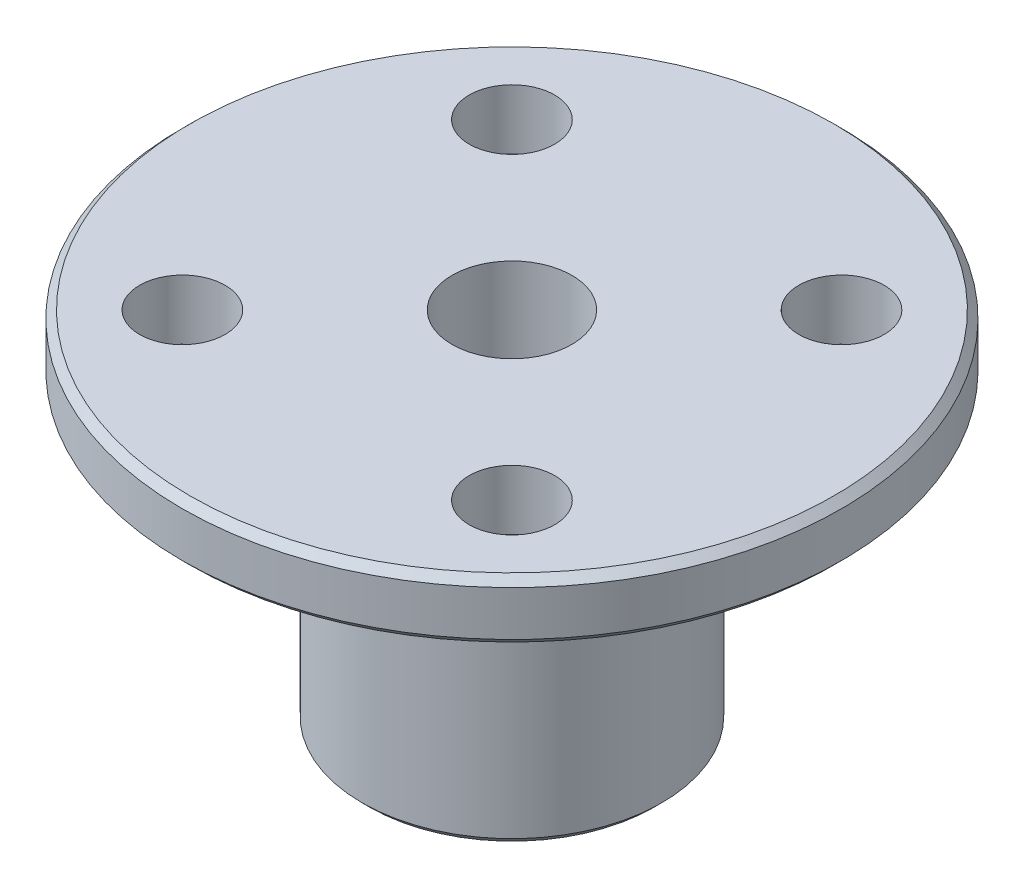
ISO-10303-21;
HEADER;
FILE_DESCRIPTION(('STEP AP214'),'2;1');
FILE_NAME('part.step','',(''),(''),'','','');
FILE_SCHEMA(('AUTOMOTIVE_DESIGN { 1 0 10303 214 1 1 1 1 }'));
ENDSEC;
DATA;
#1=APPLICATION_CONTEXT('core data for automotive mechanical design processes');
#2=APPLICATION_PROTOCOL_DEFINITION('international standard','automotive_design',2000,#1);
#3=PRODUCT_CONTEXT('',#1,'mechanical');
#4=PRODUCT('Part','Part','',(#3));
#5=PRODUCT_RELATED_PRODUCT_CATEGORY('part','',(#4));
#6=PRODUCT_DEFINITION_FORMATION('','',#4);
#7=PRODUCT_DEFINITION_CONTEXT('part definition',#1,'design');
#8=PRODUCT_DEFINITION('design','',#6,#7);
#9=PRODUCT_DEFINITION_SHAPE('','',#8);
#10=(LENGTH_UNIT() NAMED_UNIT(*) SI_UNIT(.MILLI.,.METRE.));
#11=(NAMED_UNIT(*) PLANE_ANGLE_UNIT() SI_UNIT($,.RADIAN.));
#12=(NAMED_UNIT(*) SI_UNIT($,.STERADIAN.) SOLID_ANGLE_UNIT());
#13=UNCERTAINTY_MEASURE_WITH_UNIT(LENGTH_MEASURE(1.E-05),#10,'distance_accuracy_value','');
#14=(GEOMETRIC_REPRESENTATION_CONTEXT(3) GLOBAL_UNCERTAINTY_ASSIGNED_CONTEXT((#13)) GLOBAL_UNIT_ASSIGNED_CONTEXT((#10,
#11,#12)) REPRESENTATION_CONTEXT('',''));
#15=CARTESIAN_POINT('',(0.,0.,0.));
#16=DIRECTION('',(0.,0.,1.));
#17=DIRECTION('',(1.,0.,0.));
#18=AXIS2_PLACEMENT_3D('',#15,#16,#17);
#19=CARTESIAN_POINT('',(0.,-2.,0.));
#20=DIRECTION('',(0.,1.,0.));
#21=DIRECTION('',(0.,0.,1.));
#22=AXIS2_PLACEMENT_3D('',#19,#20,#21);
#23=CYLINDRICAL_SURFACE('',#22,11.);
#24=CARTESIAN_POINT('',(0.,-1.75,0.));
#25=DIRECTION('',(0.,1.,0.));
#26=DIRECTION('',(0.,0.,1.));
#27=AXIS2_PLACEMENT_3D('',#24,#25,#26);
#28=CIRCLE('',#27,11.);
#29=CARTESIAN_POINT('',(0.,-1.75,11.));
#30=VERTEX_POINT('',#29);
#31=EDGE_CURVE('E48',#30,#30,#28,.T.);
#32=ORIENTED_EDGE('',*,*,#31,.T.);
#33=EDGE_LOOP('',(#32));
#34=FACE_BOUND('',#33,.T.);
#35=CARTESIAN_POINT('',(0.,-0.250000000000011,0.));
#36=DIRECTION('',(0.,1.,0.));
#37=DIRECTION('',(0.,0.,1.));
#38=AXIS2_PLACEMENT_3D('',#35,#36,#37);
#39=CIRCLE('',#38,11.);
#40=CARTESIAN_POINT('',(0.,-0.250000000000011,11.));
#41=VERTEX_POINT('',#40);
#42=EDGE_CURVE('E53',#41,#41,#39,.F.);
#43=ORIENTED_EDGE('',*,*,#42,.T.);
#44=EDGE_LOOP('',(#43));
#45=FACE_BOUND('',#44,.T.);
#46=ADVANCED_FACE('F39',(#34,#45),#23,.T.);
#47=CARTESIAN_POINT('',(-5.5,-2.,-5.5));
#48=DIRECTION('',(0.,1.,0.));
#49=DIRECTION('',(0.,0.,1.));
#50=AXIS2_PLACEMENT_3D('',#47,#48,#49);
#51=CYLINDRICAL_SURFACE('',#50,1.425);
#52=CARTESIAN_POINT('',(-5.5,-2.,-5.5));
#53=DIRECTION('',(0.,1.,0.));
#54=DIRECTION('',(0.,0.,1.));
#55=AXIS2_PLACEMENT_3D('',#52,#53,#54);
#56=CIRCLE('',#55,1.425);
#57=CARTESIAN_POINT('',(-5.5,-2.,-4.075));
#58=VERTEX_POINT('',#57);
#59=EDGE_CURVE('E88',#58,#58,#56,.T.);
#60=ORIENTED_EDGE('',*,*,#59,.F.);
#61=EDGE_LOOP('',(#60));
#62=FACE_BOUND('',#61,.T.);
#63=CARTESIAN_POINT('',(-5.5,0.,-5.5));
#64=DIRECTION('',(0.,1.,0.));
#65=DIRECTION('',(0.,0.,1.));
#66=AXIS2_PLACEMENT_3D('',#63,#64,#65);
#67=CIRCLE('',#66,1.425);
#68=CARTESIAN_POINT('',(-5.5,0.,-4.075));
#69=VERTEX_POINT('',#68);
#70=EDGE_CURVE('E94',#69,#69,#67,.T.);
#71=ORIENTED_EDGE('',*,*,#70,.T.);
#72=EDGE_LOOP('',(#71));
#73=FACE_BOUND('',#72,.T.);
#74=ADVANCED_FACE('F159',(#62,#73),#51,.F.);
#75=CARTESIAN_POINT('',(5.5,-2.,5.5));
#76=DIRECTION('',(0.,1.,0.));
#77=DIRECTION('',(0.,0.,1.));
#78=AXIS2_PLACEMENT_3D('',#75,#76,#77);
#79=CYLINDRICAL_SURFACE('',#78,1.425);
#80=CARTESIAN_POINT('',(5.5,-2.,5.5));
#81=DIRECTION('',(0.,1.,0.));
#82=DIRECTION('',(0.,0.,1.));
#83=AXIS2_PLACEMENT_3D('',#80,#81,#82);
#84=CIRCLE('',#83,1.425);
#85=CARTESIAN_POINT('',(5.5,-2.,6.925));
#86=VERTEX_POINT('',#85);
#87=EDGE_CURVE('E113',#86,#86,#84,.T.);
#88=ORIENTED_EDGE('',*,*,#87,.F.);
#89=EDGE_LOOP('',(#88));
#90=FACE_BOUND('',#89,.T.);
#91=CARTESIAN_POINT('',(5.5,0.,5.5));
#92=DIRECTION('',(0.,1.,0.));
#93=DIRECTION('',(0.,0.,1.));
#94=AXIS2_PLACEMENT_3D('',#91,#92,#93);
#95=CIRCLE('',#94,1.425);
#96=CARTESIAN_POINT('',(5.5,0.,6.925));
#97=VERTEX_POINT('',#96);
#98=EDGE_CURVE('E98',#97,#97,#95,.T.);
#99=ORIENTED_EDGE('',*,*,#98,.T.);
#100=EDGE_LOOP('',(#99));
#101=FACE_BOUND('',#100,.T.);
#102=ADVANCED_FACE('F163',(#90,#101),#79,.F.);
#103=CARTESIAN_POINT('',(5.5,-2.,-5.5));
#104=DIRECTION('',(0.,1.,0.));
#105=DIRECTION('',(0.,0.,1.));
#106=AXIS2_PLACEMENT_3D('',#103,#104,#105);
#107=CYLINDRICAL_SURFACE('',#106,1.425);
#108=CARTESIAN_POINT('',(5.5,-2.,-5.5));
#109=DIRECTION('',(0.,1.,0.));
#110=DIRECTION('',(0.,0.,1.));
#111=AXIS2_PLACEMENT_3D('',#108,#109,#110);
#112=CIRCLE('',#111,1.425);
#113=CARTESIAN_POINT('',(5.5,-2.,-4.075));
#114=VERTEX_POINT('',#113);
#115=EDGE_CURVE('E117',#114,#114,#112,.T.);
#116=ORIENTED_EDGE('',*,*,#115,.F.);
#117=EDGE_LOOP('',(#116));
#118=FACE_BOUND('',#117,.T.);
#119=CARTESIAN_POINT('',(5.5,0.,-5.5));
#120=DIRECTION('',(0.,1.,0.));
#121=DIRECTION('',(0.,0.,1.));
#122=AXIS2_PLACEMENT_3D('',#119,#120,#121);
#123=CIRCLE('',#122,1.425);
#124=CARTESIAN_POINT('',(5.5,0.,-4.075));
#125=VERTEX_POINT('',#124);
#126=EDGE_CURVE('E102',#125,#125,#123,.T.);
#127=ORIENTED_EDGE('',*,*,#126,.T.);
#128=EDGE_LOOP('',(#127));
#129=FACE_BOUND('',#128,.T.);
#130=ADVANCED_FACE('F132',(#118,#129),#107,.F.);
#131=CARTESIAN_POINT('',(-5.5,-2.,5.5));
#132=DIRECTION('',(0.,1.,0.));
#133=DIRECTION('',(0.,0.,1.));
#134=AXIS2_PLACEMENT_3D('',#131,#132,#133);
#135=CYLINDRICAL_SURFACE('',#134,1.425);
#136=CARTESIAN_POINT('',(-5.5,-2.,5.5));
#137=DIRECTION('',(0.,1.,0.));
#138=DIRECTION('',(0.,0.,1.));
#139=AXIS2_PLACEMENT_3D('',#136,#137,#138);
#140=CIRCLE('',#139,1.425);
#141=CARTESIAN_POINT('',(-5.5,-2.,6.925));
#142=VERTEX_POINT('',#141);
#143=EDGE_CURVE('E93',#142,#142,#140,.T.);
#144=ORIENTED_EDGE('',*,*,#143,.F.);
#145=EDGE_LOOP('',(#144));
#146=FACE_BOUND('',#145,.T.);
#147=CARTESIAN_POINT('',(-5.5,0.,5.5));
#148=DIRECTION('',(0.,1.,0.));
#149=DIRECTION('',(0.,0.,1.));
#150=AXIS2_PLACEMENT_3D('',#147,#148,#149);
#151=CIRCLE('',#150,1.425);
#152=CARTESIAN_POINT('',(-5.5,0.,6.925));
#153=VERTEX_POINT('',#152);
#154=EDGE_CURVE('E106',#153,#153,#151,.T.);
#155=ORIENTED_EDGE('',*,*,#154,.T.);
#156=EDGE_LOOP('',(#155));
#157=FACE_BOUND('',#156,.T.);
#158=ADVANCED_FACE('F128',(#146,#157),#135,.F.);
#159=CARTESIAN_POINT('',(0.,-2.,0.));
#160=DIRECTION('',(0.,1.,0.));
#161=DIRECTION('',(0.,0.,1.));
#162=AXIS2_PLACEMENT_3D('',#159,#160,#161);
#163=CYLINDRICAL_SURFACE('',#162,2.);
#164=CARTESIAN_POINT('',(0.,-11.75,0.));
#165=DIRECTION('',(0.,1.,0.));
#166=DIRECTION('',(0.,0.,1.));
#167=AXIS2_PLACEMENT_3D('',#164,#165,#166);
#168=CIRCLE('',#167,2.);
#169=CARTESIAN_POINT('',(0.,-11.75,2.));
#170=VERTEX_POINT('',#169);
#171=EDGE_CURVE('E76',#170,#170,#168,.F.);
#172=ORIENTED_EDGE('',*,*,#171,.T.);
#173=EDGE_LOOP('',(#172));
#174=FACE_BOUND('',#173,.T.);
#175=CARTESIAN_POINT('',(0.,0.,0.));
#176=DIRECTION('',(0.,1.,0.));
#177=DIRECTION('',(0.,0.,1.));
#178=AXIS2_PLACEMENT_3D('',#175,#176,#177);
#179=CIRCLE('',#178,2.);
#180=CARTESIAN_POINT('',(0.,0.,2.));
#181=VERTEX_POINT('',#180);
#182=EDGE_CURVE('E89',#181,#181,#179,.T.);
#183=ORIENTED_EDGE('',*,*,#182,.T.);
#184=EDGE_LOOP('',(#183));
#185=FACE_BOUND('',#184,.T.);
#186=ADVANCED_FACE('F131',(#174,#185),#163,.F.);
#187=CARTESIAN_POINT('',(0.,-2.,0.));
#188=DIRECTION('',(0.,1.,0.));
#189=DIRECTION('',(0.,0.,1.));
#190=AXIS2_PLACEMENT_3D('',#187,#188,#189);
#191=PLANE('',#190);
#192=CARTESIAN_POINT('',(0.,-2.,0.));
#193=DIRECTION('',(0.,1.,0.));
#194=DIRECTION('',(0.,0.,1.));
#195=AXIS2_PLACEMENT_3D('',#192,#193,#194);
#196=CIRCLE('',#195,5.25);
#197=CARTESIAN_POINT('',(0.,-2.,5.25));
#198=VERTEX_POINT('',#197);
#199=EDGE_CURVE('E68',#198,#198,#196,.T.);
#200=ORIENTED_EDGE('',*,*,#199,.T.);
#201=EDGE_LOOP('',(#200));
#202=FACE_BOUND('',#201,.T.);
#203=CARTESIAN_POINT('',(0.,-2.,0.));
#204=DIRECTION('',(0.,1.,0.));
#205=DIRECTION('',(0.,0.,1.));
#206=AXIS2_PLACEMENT_3D('',#203,#204,#205);
#207=CIRCLE('',#206,10.75);
#208=CARTESIAN_POINT('',(0.,-2.,10.75));
#209=VERTEX_POINT('',#208);
#210=EDGE_CURVE('E72',#209,#209,#207,.F.);
#211=ORIENTED_EDGE('',*,*,#210,.T.);
#212=EDGE_LOOP('',(#211));
#213=FACE_BOUND('',#212,.T.);
#214=ORIENTED_EDGE('',*,*,#143,.T.);
#215=EDGE_LOOP('',(#214));
#216=FACE_BOUND('',#215,.T.);
#217=ORIENTED_EDGE('',*,*,#115,.T.);
#218=EDGE_LOOP('',(#217));
#219=FACE_BOUND('',#218,.T.);
#220=ORIENTED_EDGE('',*,*,#87,.T.);
#221=EDGE_LOOP('',(#220));
#222=FACE_BOUND('',#221,.T.);
#223=ORIENTED_EDGE('',*,*,#59,.T.);
#224=EDGE_LOOP('',(#223));
#225=FACE_BOUND('',#224,.T.);
#226=ADVANCED_FACE('F125',(#202,#213,#216,#219,#222,#225),#191,.F.);
#227=CARTESIAN_POINT('',(0.,0.,0.));
#228=DIRECTION('',(0.,1.,0.));
#229=DIRECTION('',(0.,0.,1.));
#230=AXIS2_PLACEMENT_3D('',#227,#228,#229);
#231=PLANE('',#230);
#232=CARTESIAN_POINT('',(0.,0.,0.));
#233=DIRECTION('',(0.,1.,0.));
#234=DIRECTION('',(0.,0.,1.));
#235=AXIS2_PLACEMENT_3D('',#232,#233,#234);
#236=CIRCLE('',#235,10.75);
#237=CARTESIAN_POINT('',(0.,0.,10.75));
#238=VERTEX_POINT('',#237);
#239=EDGE_CURVE('E10',#238,#238,#236,.T.);
#240=ORIENTED_EDGE('',*,*,#239,.T.);
#241=EDGE_LOOP('',(#240));
#242=FACE_BOUND('',#241,.T.);
#243=ORIENTED_EDGE('',*,*,#154,.F.);
#244=EDGE_LOOP('',(#243));
#245=FACE_BOUND('',#244,.T.);
#246=ORIENTED_EDGE('',*,*,#126,.F.);
#247=EDGE_LOOP('',(#246));
#248=FACE_BOUND('',#247,.T.);
#249=ORIENTED_EDGE('',*,*,#98,.F.);
#250=EDGE_LOOP('',(#249));
#251=FACE_BOUND('',#250,.T.);
#252=ORIENTED_EDGE('',*,*,#70,.F.);
#253=EDGE_LOOP('',(#252));
#254=FACE_BOUND('',#253,.T.);
#255=ORIENTED_EDGE('',*,*,#182,.F.);
#256=EDGE_LOOP('',(#255));
#257=FACE_BOUND('',#256,.T.);
#258=ADVANCED_FACE('F136',(#242,#245,#248,#251,#254,#257),#231,.T.);
#259=CARTESIAN_POINT('',(0.,-12.,0.));
#260=DIRECTION('',(0.,1.,0.));
#261=DIRECTION('',(0.,0.,1.));
#262=AXIS2_PLACEMENT_3D('',#259,#260,#261);
#263=CYLINDRICAL_SURFACE('',#262,5.);
#264=CARTESIAN_POINT('',(0.,-2.25,0.));
#265=DIRECTION('',(0.,1.,0.));
#266=DIRECTION('',(0.,0.,1.));
#267=AXIS2_PLACEMENT_3D('',#264,#265,#266);
#268=CIRCLE('',#267,5.);
#269=CARTESIAN_POINT('',(0.,-2.25,5.));
#270=VERTEX_POINT('',#269);
#271=EDGE_CURVE('E58',#270,#270,#268,.F.);
#272=ORIENTED_EDGE('',*,*,#271,.T.);
#273=EDGE_LOOP('',(#272));
#274=FACE_BOUND('',#273,.T.);
#275=CARTESIAN_POINT('',(0.,-11.75,0.));
#276=DIRECTION('',(0.,1.,0.));
#277=DIRECTION('',(0.,0.,1.));
#278=AXIS2_PLACEMENT_3D('',#275,#276,#277);
#279=CIRCLE('',#278,5.);
#280=CARTESIAN_POINT('',(0.,-11.75,5.));
#281=VERTEX_POINT('',#280);
#282=EDGE_CURVE('E64',#281,#281,#279,.T.);
#283=ORIENTED_EDGE('',*,*,#282,.T.);
#284=EDGE_LOOP('',(#283));
#285=FACE_BOUND('',#284,.T.);
#286=ADVANCED_FACE('F139',(#274,#285),#263,.T.);
#287=CARTESIAN_POINT('',(0.,-12.,0.));
#288=DIRECTION('',(0.,1.,0.));
#289=DIRECTION('',(0.,0.,1.));
#290=AXIS2_PLACEMENT_3D('',#287,#288,#289);
#291=PLANE('',#290);
#292=CARTESIAN_POINT('',(0.,-12.,0.));
#293=DIRECTION('',(0.,1.,0.));
#294=DIRECTION('',(0.,0.,1.));
#295=AXIS2_PLACEMENT_3D('',#292,#293,#294);
#296=CIRCLE('',#295,2.25);
#297=CARTESIAN_POINT('',(0.,-12.,2.25));
#298=VERTEX_POINT('',#297);
#299=EDGE_CURVE('E80',#298,#298,#296,.T.);
#300=ORIENTED_EDGE('',*,*,#299,.T.);
#301=EDGE_LOOP('',(#300));
#302=FACE_BOUND('',#301,.T.);
#303=CARTESIAN_POINT('',(0.,-12.,0.));
#304=DIRECTION('',(0.,1.,0.));
#305=DIRECTION('',(0.,0.,1.));
#306=AXIS2_PLACEMENT_3D('',#303,#304,#305);
#307=CIRCLE('',#306,4.74999999999999);
#308=CARTESIAN_POINT('',(0.,-12.,4.74999999999999));
#309=VERTEX_POINT('',#308);
#310=EDGE_CURVE('E84',#309,#309,#307,.F.);
#311=ORIENTED_EDGE('',*,*,#310,.T.);
#312=EDGE_LOOP('',(#311));
#313=FACE_BOUND('',#312,.T.);
#314=ADVANCED_FACE('F182',(#302,#313),#291,.F.);
#315=CARTESIAN_POINT('',(0.,-12.,0.));
#316=DIRECTION('',(0.,-1.,0.));
#317=DIRECTION('',(0.,0.,-1.));
#318=AXIS2_PLACEMENT_3D('',#315,#316,#317);
#319=CONICAL_SURFACE('',#318,2.25,0.785398163397448);
#320=ORIENTED_EDGE('',*,*,#171,.F.);
#321=EDGE_LOOP('',(#320));
#322=FACE_BOUND('',#321,.T.);
#323=ORIENTED_EDGE('',*,*,#299,.F.);
#324=EDGE_LOOP('',(#323));
#325=FACE_BOUND('',#324,.T.);
#326=ADVANCED_FACE('F175',(#322,#325),#319,.F.);
#327=CARTESIAN_POINT('',(0.,-2.,0.));
#328=DIRECTION('',(0.,1.,0.));
#329=DIRECTION('',(0.,0.,1.));
#330=AXIS2_PLACEMENT_3D('',#327,#328,#329);
#331=CONICAL_SURFACE('',#330,5.25,0.785398163397454);
#332=ORIENTED_EDGE('',*,*,#271,.F.);
#333=EDGE_LOOP('',(#332));
#334=FACE_BOUND('',#333,.T.);
#335=ORIENTED_EDGE('',*,*,#199,.F.);
#336=EDGE_LOOP('',(#335));
#337=FACE_BOUND('',#336,.T.);
#338=ADVANCED_FACE('F181',(#334,#337),#331,.T.);
#339=CARTESIAN_POINT('',(0.,-11.75,0.));
#340=DIRECTION('',(0.,1.,0.));
#341=DIRECTION('',(0.,0.,1.));
#342=AXIS2_PLACEMENT_3D('',#339,#340,#341);
#343=CONICAL_SURFACE('',#342,5.,0.785398163397453);
#344=ORIENTED_EDGE('',*,*,#310,.F.);
#345=EDGE_LOOP('',(#344));
#346=FACE_BOUND('',#345,.T.);
#347=ORIENTED_EDGE('',*,*,#282,.F.);
#348=EDGE_LOOP('',(#347));
#349=FACE_BOUND('',#348,.T.);
#350=ADVANCED_FACE('F189',(#346,#349),#343,.T.);
#351=CARTESIAN_POINT('',(0.,-1.75,0.));
#352=DIRECTION('',(0.,1.,0.));
#353=DIRECTION('',(0.,0.,1.));
#354=AXIS2_PLACEMENT_3D('',#351,#352,#353);
#355=CONICAL_SURFACE('',#354,11.,0.785398163397455);
#356=ORIENTED_EDGE('',*,*,#210,.F.);
#357=EDGE_LOOP('',(#356));
#358=FACE_BOUND('',#357,.T.);
#359=ORIENTED_EDGE('',*,*,#31,.F.);
#360=EDGE_LOOP('',(#359));
#361=FACE_BOUND('',#360,.T.);
#362=ADVANCED_FACE('F195',(#358,#361),#355,.T.);
#363=CARTESIAN_POINT('',(0.,0.,0.));
#364=DIRECTION('',(0.,-1.,0.));
#365=DIRECTION('',(0.,0.,-1.));
#366=AXIS2_PLACEMENT_3D('',#363,#364,#365);
#367=CONICAL_SURFACE('',#366,10.75,0.785398163397428);
#368=ORIENTED_EDGE('',*,*,#42,.F.);
#369=EDGE_LOOP('',(#368));
#370=FACE_BOUND('',#369,.T.);
#371=ORIENTED_EDGE('',*,*,#239,.F.);
#372=EDGE_LOOP('',(#371));
#373=FACE_BOUND('',#372,.T.);
#374=ADVANCED_FACE('F42',(#370,#373),#367,.T.);
#375=CLOSED_SHELL('',(#46,#74,#102,#130,#158,#186,#226,#258,#286,#314,#326,#338,#350,#362,#374));
#376=MANIFOLD_SOLID_BREP('B2',#375);
#377=ADVANCED_BREP_SHAPE_REPRESENTATION('',(#18,#376),#14);
#378=SHAPE_DEFINITION_REPRESENTATION(#9,#377);
ENDSEC;
END-ISO-10303-21;
